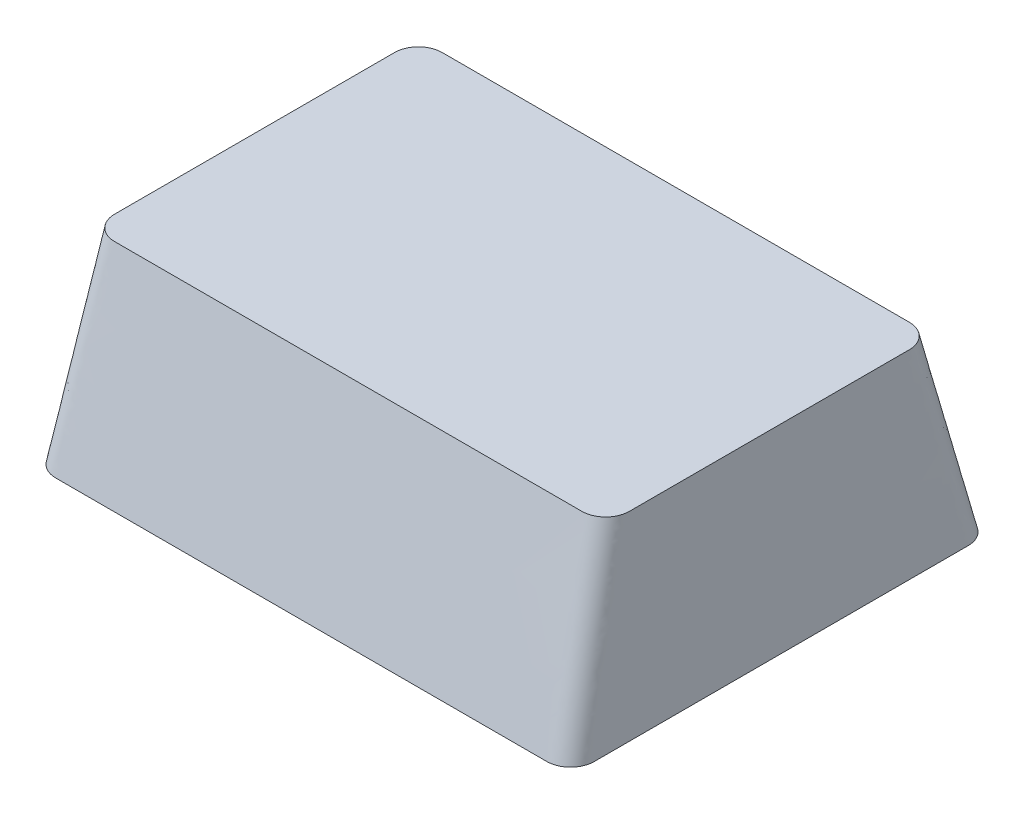
ISO-10303-21;
HEADER;
FILE_DESCRIPTION(('STEP AP214'),'2;1');
FILE_NAME('part.step','',(''),(''),'','','');
FILE_SCHEMA(('AUTOMOTIVE_DESIGN { 1 0 10303 214 1 1 1 1 }'));
ENDSEC;
DATA;
#1=APPLICATION_CONTEXT('core data for automotive mechanical design processes');
#2=APPLICATION_PROTOCOL_DEFINITION('international standard','automotive_design',2000,#1);
#3=PRODUCT_CONTEXT('',#1,'mechanical');
#4=PRODUCT('Part','Part','',(#3));
#5=PRODUCT_RELATED_PRODUCT_CATEGORY('part','',(#4));
#6=PRODUCT_DEFINITION_FORMATION('','',#4);
#7=PRODUCT_DEFINITION_CONTEXT('part definition',#1,'design');
#8=PRODUCT_DEFINITION('design','',#6,#7);
#9=PRODUCT_DEFINITION_SHAPE('','',#8);
#10=(LENGTH_UNIT() NAMED_UNIT(*) SI_UNIT(.MILLI.,.METRE.));
#11=(NAMED_UNIT(*) PLANE_ANGLE_UNIT() SI_UNIT($,.RADIAN.));
#12=(NAMED_UNIT(*) SI_UNIT($,.STERADIAN.) SOLID_ANGLE_UNIT());
#13=UNCERTAINTY_MEASURE_WITH_UNIT(LENGTH_MEASURE(1.E-05),#10,'distance_accuracy_value','');
#14=(GEOMETRIC_REPRESENTATION_CONTEXT(3) GLOBAL_UNCERTAINTY_ASSIGNED_CONTEXT((#13)) GLOBAL_UNIT_ASSIGNED_CONTEXT((#10,
#11,#12)) REPRESENTATION_CONTEXT('',''));
#15=CARTESIAN_POINT('',(0.,0.,0.));
#16=DIRECTION('',(0.,0.,1.));
#17=DIRECTION('',(1.,0.,0.));
#18=AXIS2_PLACEMENT_3D('',#15,#16,#17);
#19=CARTESIAN_POINT('',(-10.4902,0.,-7.9883));
#20=DIRECTION('',(0.,-1.,0.));
#21=DIRECTION('',(0.,0.,-1.));
#22=AXIS2_PLACEMENT_3D('',#19,#20,#21);
#23=PLANE('',#22);
#24=CARTESIAN_POINT('',(-10.4902,0.,-7.9883));
#25=DIRECTION('',(0.,1.,0.));
#26=DIRECTION('',(0.,0.,-1.));
#27=AXIS2_PLACEMENT_3D('',#24,#25,#26);
#28=CIRCLE('',#27,1.016);
#29=CARTESIAN_POINT('',(-10.4901999999162,0.,-9.0043));
#30=VERTEX_POINT('',#29);
#31=CARTESIAN_POINT('',(-11.5062,0.,-7.9883));
#32=VERTEX_POINT('',#31);
#33=EDGE_CURVE('E309',#30,#32,#28,.T.);
#34=ORIENTED_EDGE('',*,*,#33,.F.);
#35=DIRECTION('',(-1.,0.,0.));
#36=VECTOR('',#35,1.);
#37=CARTESIAN_POINT('',(-10.4902,0.,-9.0043));
#38=LINE('',#37,#36);
#39=CARTESIAN_POINT('',(10.4902,0.,-9.0043));
#40=VERTEX_POINT('',#39);
#41=EDGE_CURVE('E541',#40,#30,#38,.T.);
#42=ORIENTED_EDGE('',*,*,#41,.F.);
#43=CARTESIAN_POINT('',(10.4902,0.,-7.9883));
#44=DIRECTION('',(0.,1.,0.));
#45=DIRECTION('',(0.,0.,-1.));
#46=AXIS2_PLACEMENT_3D('',#43,#44,#45);
#47=CIRCLE('',#46,1.016);
#48=CARTESIAN_POINT('',(11.5062,0.,-7.98829999999678));
#49=VERTEX_POINT('',#48);
#50=EDGE_CURVE('E532',#49,#40,#47,.T.);
#51=ORIENTED_EDGE('',*,*,#50,.F.);
#52=DIRECTION('',(0.,0.,-1.));
#53=VECTOR('',#52,1.);
#54=CARTESIAN_POINT('',(11.5062,0.,7.9883));
#55=LINE('',#54,#53);
#56=CARTESIAN_POINT('',(11.5062,0.,7.98829999991866));
#57=VERTEX_POINT('',#56);
#58=EDGE_CURVE('E523',#57,#49,#55,.T.);
#59=ORIENTED_EDGE('',*,*,#58,.F.);
#60=CARTESIAN_POINT('',(10.4902,0.,7.9883));
#61=DIRECTION('',(0.,1.,0.));
#62=DIRECTION('',(0.,0.,1.));
#63=AXIS2_PLACEMENT_3D('',#60,#61,#62);
#64=CIRCLE('',#63,1.016);
#65=CARTESIAN_POINT('',(10.4901999999165,0.,9.0043));
#66=VERTEX_POINT('',#65);
#67=EDGE_CURVE('E514',#66,#57,#64,.T.);
#68=ORIENTED_EDGE('',*,*,#67,.F.);
#69=DIRECTION('',(1.,0.,0.));
#70=VECTOR('',#69,1.);
#71=CARTESIAN_POINT('',(-10.4902,0.,9.0043));
#72=LINE('',#71,#70);
#73=CARTESIAN_POINT('',(-10.4902,0.,9.0043));
#74=VERTEX_POINT('',#73);
#75=EDGE_CURVE('E508',#74,#66,#72,.T.);
#76=ORIENTED_EDGE('',*,*,#75,.F.);
#77=CARTESIAN_POINT('',(-10.4902,0.,7.9883));
#78=DIRECTION('',(0.,1.,0.));
#79=DIRECTION('',(0.,0.,-1.));
#80=AXIS2_PLACEMENT_3D('',#77,#78,#79);
#81=CIRCLE('',#80,1.016);
#82=CARTESIAN_POINT('',(-11.5062,0.,7.9883));
#83=VERTEX_POINT('',#82);
#84=EDGE_CURVE('E242',#83,#74,#81,.T.);
#85=ORIENTED_EDGE('',*,*,#84,.F.);
#86=DIRECTION('',(0.,0.,1.));
#87=VECTOR('',#86,1.);
#88=CARTESIAN_POINT('',(-11.5062,0.,7.9883));
#89=LINE('',#88,#87);
#90=EDGE_CURVE('E12',#32,#83,#89,.T.);
#91=ORIENTED_EDGE('',*,*,#90,.F.);
#92=EDGE_LOOP('',(#34,#42,#51,#59,#68,#76,#85,#91));
#93=FACE_BOUND('',#92,.T.);
#94=ADVANCED_FACE('F232',(#93),#23,.T.);
#95=CARTESIAN_POINT('',(9.9822,8.001,-5.9817));
#96=DIRECTION('',(0.,-1.,0.));
#97=DIRECTION('',(0.,0.,-1.));
#98=AXIS2_PLACEMENT_3D('',#95,#96,#97);
#99=PLANE('',#98);
#100=CARTESIAN_POINT('',(9.9822,8.001,-5.9817));
#101=DIRECTION('',(0.,1.,0.));
#102=DIRECTION('',(0.,0.,-1.));
#103=AXIS2_PLACEMENT_3D('',#100,#101,#102);
#104=CIRCLE('',#103,1.016);
#105=CARTESIAN_POINT('',(10.9982,8.001,-5.9817));
#106=VERTEX_POINT('',#105);
#107=CARTESIAN_POINT('',(9.9822,8.001,-6.9977));
#108=VERTEX_POINT('',#107);
#109=EDGE_CURVE('E305',#106,#108,#104,.T.);
#110=ORIENTED_EDGE('',*,*,#109,.T.);
#111=DIRECTION('',(-1.,0.,0.));
#112=VECTOR('',#111,1.);
#113=CARTESIAN_POINT('',(-9.9822,8.001,-6.9977));
#114=LINE('',#113,#112);
#115=CARTESIAN_POINT('',(-9.9822,8.001,-6.9977));
#116=VERTEX_POINT('',#115);
#117=EDGE_CURVE('E297',#108,#116,#114,.T.);
#118=ORIENTED_EDGE('',*,*,#117,.T.);
#119=CARTESIAN_POINT('',(-9.9822,8.001,-5.9817));
#120=DIRECTION('',(0.,1.,0.));
#121=DIRECTION('',(0.,0.,-1.));
#122=AXIS2_PLACEMENT_3D('',#119,#120,#121);
#123=CIRCLE('',#122,1.016);
#124=CARTESIAN_POINT('',(-10.9982,8.001,-5.9817));
#125=VERTEX_POINT('',#124);
#126=EDGE_CURVE('E301',#116,#125,#123,.T.);
#127=ORIENTED_EDGE('',*,*,#126,.T.);
#128=DIRECTION('',(0.,0.,1.));
#129=VECTOR('',#128,1.);
#130=CARTESIAN_POINT('',(-10.9982,8.001,5.9817));
#131=LINE('',#130,#129);
#132=CARTESIAN_POINT('',(-10.9982,8.001,5.9817));
#133=VERTEX_POINT('',#132);
#134=EDGE_CURVE('E316',#125,#133,#131,.T.);
#135=ORIENTED_EDGE('',*,*,#134,.T.);
#136=CARTESIAN_POINT('',(-9.9822,8.001,5.9817));
#137=DIRECTION('',(0.,1.,0.));
#138=DIRECTION('',(0.,0.,-1.));
#139=AXIS2_PLACEMENT_3D('',#136,#137,#138);
#140=CIRCLE('',#139,1.016);
#141=CARTESIAN_POINT('',(-9.9822,8.001,6.9977));
#142=VERTEX_POINT('',#141);
#143=EDGE_CURVE('E440',#133,#142,#140,.T.);
#144=ORIENTED_EDGE('',*,*,#143,.T.);
#145=DIRECTION('',(1.,0.,0.));
#146=VECTOR('',#145,1.);
#147=CARTESIAN_POINT('',(-9.9822,8.001,6.9977));
#148=LINE('',#147,#146);
#149=CARTESIAN_POINT('',(9.9822,8.001,6.9977));
#150=VERTEX_POINT('',#149);
#151=EDGE_CURVE('E457',#142,#150,#148,.T.);
#152=ORIENTED_EDGE('',*,*,#151,.T.);
#153=CARTESIAN_POINT('',(9.9822,8.001,5.9817));
#154=DIRECTION('',(0.,1.,0.));
#155=DIRECTION('',(0.,0.,1.));
#156=AXIS2_PLACEMENT_3D('',#153,#154,#155);
#157=CIRCLE('',#156,1.016);
#158=CARTESIAN_POINT('',(10.9982,8.001,5.9817));
#159=VERTEX_POINT('',#158);
#160=EDGE_CURVE('E460',#150,#159,#157,.T.);
#161=ORIENTED_EDGE('',*,*,#160,.T.);
#162=DIRECTION('',(0.,0.,-1.));
#163=VECTOR('',#162,1.);
#164=CARTESIAN_POINT('',(10.9982,8.001,5.9817));
#165=LINE('',#164,#163);
#166=EDGE_CURVE('E478',#159,#106,#165,.T.);
#167=ORIENTED_EDGE('',*,*,#166,.T.);
#168=EDGE_LOOP('',(#110,#118,#127,#135,#144,#152,#161,#167));
#169=FACE_BOUND('',#168,.T.);
#170=ADVANCED_FACE('F300',(#169),#99,.F.);
#171=CARTESIAN_POINT('',(-9.9821999992146,8.001,-6.9977));
#172=CARTESIAN_POINT('',(-10.4901999991776,0.,-9.0043));
#173=CARTESIAN_POINT('',(-8.3156387090877,8.001,-6.9977));
#174=CARTESIAN_POINT('',(-8.74510436639633,0.,-9.0043));
#175=CARTESIAN_POINT('',(-4.9868189676382,8.001,-6.99769999999999));
#176=CARTESIAN_POINT('',(-5.25002016085883,0.,-9.00430000000001));
#177=CARTESIAN_POINT('',(0.,8.001,-6.99770000000001));
#178=CARTESIAN_POINT('',(0.,0.,-9.0043));
#179=CARTESIAN_POINT('',(4.9868189676382,8.00099999999999,-6.99769999999999));
#180=CARTESIAN_POINT('',(5.25002016085883,0.,-9.0043));
#181=CARTESIAN_POINT('',(8.31563870908769,8.001,-6.9977));
#182=CARTESIAN_POINT('',(8.74510436639632,0.,-9.0043));
#183=CARTESIAN_POINT('',(10.1123327972429,8.001,-6.9977));
#184=CARTESIAN_POINT('',(10.6264651211783,0.,-9.0043));
#185=CARTESIAN_POINT('',(10.3850781656718,8.001,-6.94637622935646));
#186=CARTESIAN_POINT('',(10.8866226484583,0.,-8.9500537005938));
#187=CARTESIAN_POINT('',(10.7407733927544,8.001,-6.70112265072094));
#188=CARTESIAN_POINT('',(11.211070009126,0.,-8.73824626538668));
#189=CARTESIAN_POINT('',(10.9574755196119,8.001,-6.34672996806996));
#190=CARTESIAN_POINT('',(11.4403443291089,0.,-8.41639388634618));
#191=CARTESIAN_POINT('',(10.9982,8.001,-6.0985563767538));
#192=CARTESIAN_POINT('',(11.5062,0.,-8.13974274963668));
#193=CARTESIAN_POINT('',(10.9982,8.001,-4.96861228851217));
#194=CARTESIAN_POINT('',(11.5062,0.,-6.67536532828676));
#195=CARTESIAN_POINT('',(10.9982,8.001,-2.96721368440715));
#196=CARTESIAN_POINT('',(11.5062,0.,-4.0223987692796));
#197=CARTESIAN_POINT('',(10.9982,8.001,0.));
#198=CARTESIAN_POINT('',(11.5062,0.,0.));
#199=CARTESIAN_POINT('',(10.9982,8.001,2.96721368440716));
#200=CARTESIAN_POINT('',(11.5062,0.,4.0223987692796));
#201=CARTESIAN_POINT('',(10.9982,8.001,4.96861228851217));
#202=CARTESIAN_POINT('',(11.5062,0.,6.67536532828676));
#203=CARTESIAN_POINT('',(10.9982,8.001,6.0985563767538));
#204=CARTESIAN_POINT('',(11.5062,0.,8.13974274963668));
#205=CARTESIAN_POINT('',(10.9574755196119,8.00099999999999,6.34672996806995));
#206=CARTESIAN_POINT('',(11.4403443291089,0.,8.41639388634617));
#207=CARTESIAN_POINT('',(10.7407733927544,8.00100000000001,6.70112265072096));
#208=CARTESIAN_POINT('',(11.211070009126,0.,8.73824626538669));
#209=CARTESIAN_POINT('',(10.3850781656718,8.00099999999999,6.94637622935646));
#210=CARTESIAN_POINT('',(10.8866226484583,0.,8.9500537005938));
#211=CARTESIAN_POINT('',(10.1123327972429,8.001,6.9977));
#212=CARTESIAN_POINT('',(10.6264651211783,0.,9.0043));
#213=CARTESIAN_POINT('',(8.31563870908769,8.001,6.9977));
#214=CARTESIAN_POINT('',(8.74510436639633,0.,9.0043));
#215=CARTESIAN_POINT('',(4.9868189676382,8.001,6.9977));
#216=CARTESIAN_POINT('',(5.25002016085883,0.,9.00430000000001));
#217=CARTESIAN_POINT('',(0.,8.00099999999999,6.99770000000001));
#218=CARTESIAN_POINT('',(0.,0.,9.0043));
#219=CARTESIAN_POINT('',(-4.9868189676382,8.001,6.99769999999999));
#220=CARTESIAN_POINT('',(-5.25002016085881,0.,9.0043));
#221=CARTESIAN_POINT('',(-8.3156387090877,8.001,6.9977));
#222=CARTESIAN_POINT('',(-8.74510436639633,0.,9.0043));
#223=CARTESIAN_POINT('',(-10.1123327972429,8.001,6.9977));
#224=CARTESIAN_POINT('',(-10.6264651211783,0.,9.0043));
#225=CARTESIAN_POINT('',(-10.3850781656718,8.001,6.94637622935647));
#226=CARTESIAN_POINT('',(-10.8866226484583,0.,8.9500537005938));
#227=CARTESIAN_POINT('',(-10.7407733927544,8.00099999999999,6.70112265072094));
#228=CARTESIAN_POINT('',(-11.211070009126,0.,8.73824626538668));
#229=CARTESIAN_POINT('',(-10.9574755196119,8.001,6.34672996806996));
#230=CARTESIAN_POINT('',(-11.4403443291089,0.,8.41639388634619));
#231=CARTESIAN_POINT('',(-10.9982,8.001,6.0985563767538));
#232=CARTESIAN_POINT('',(-11.5062,0.,8.13974274963668));
#233=CARTESIAN_POINT('',(-10.9982,8.001,4.96861228851217));
#234=CARTESIAN_POINT('',(-11.5062,0.,6.67536532828676));
#235=CARTESIAN_POINT('',(-10.9982,8.001,2.96721368440716));
#236=CARTESIAN_POINT('',(-11.5062,0.,4.0223987692796));
#237=CARTESIAN_POINT('',(-10.9982,8.00099999999999,0.));
#238=CARTESIAN_POINT('',(-11.5062,0.,0.));
#239=CARTESIAN_POINT('',(-10.9982,8.001,-2.96721368440715));
#240=CARTESIAN_POINT('',(-11.5062,0.,-4.0223987692796));
#241=CARTESIAN_POINT('',(-10.9982,8.001,-4.96861228851217));
#242=CARTESIAN_POINT('',(-11.5062,0.,-6.67536532828676));
#243=CARTESIAN_POINT('',(-10.9982,8.001,-6.0985563767538));
#244=CARTESIAN_POINT('',(-11.5062,0.,-8.13974274963668));
#245=CARTESIAN_POINT('',(-10.9574755196119,8.00100000000001,-6.34672996806996));
#246=CARTESIAN_POINT('',(-11.4403443291089,0.,-8.41639388634617));
#247=CARTESIAN_POINT('',(-10.7407733927544,8.00099999999999,-6.70112265072095));
#248=CARTESIAN_POINT('',(-11.211070009126,0.,-8.73824626538669));
#249=CARTESIAN_POINT('',(-10.3850781656718,8.001,-6.94637622935646));
#250=CARTESIAN_POINT('',(-10.8866226484583,0.,-8.9500537005938));
#251=CARTESIAN_POINT('',(-10.1123327972429,8.001,-6.9977));
#252=CARTESIAN_POINT('',(-10.6264651211783,0.,-9.0043));
#253=CARTESIAN_POINT('',(-9.9821999992146,8.001,-6.9977));
#254=CARTESIAN_POINT('',(-10.4901999991776,0.,-9.0043));
#255=B_SPLINE_SURFACE_WITH_KNOTS('',3,1,((#171,#172),(#173,#174),(#175,#176),(#177,#178),(#179,
#180),(#181,#182),(#183,#184),(#185,#186),(#187,#188),(#189,#190),(#191,#192),(#193,#194),(#195,
#196),(#197,#198),(#199,#200),(#201,#202),(#203,#204),(#205,#206),(#207,#208),(#209,#210),(#211,
#212),(#213,#214),(#215,#216),(#217,#218),(#219,#220),(#221,#222),(#223,#224),(#225,#226),(#227,
#228),(#229,#230),(#231,#232),(#233,#234),(#235,#236),(#237,#238),(#239,#240),(#241,#242),(#243,
#244),(#245,#246),(#247,#248),(#249,#250),(#251,#252),(#253,#254)),.UNSPECIFIED.,.T.,.F.,.F.,(4,
1,1,1,2,1,1,1,2,1,1,1,2,1,1,1,2,1,1,1,2,1,1,1,2,1,1,1,2,1,1,1,4),(2,2),(0.,0.068189577858536,
0.136379155717072,0.204568733575608,0.272758311434144,0.27808286842204,0.283407425409937,
0.288731982397833,0.294056539385729,0.3402178475514,0.386379155717072,0.432540463882744,
0.478701772048415,0.484026329036311,0.489350886024208,0.494675443012104,0.5,0.568189577858536,
0.636379155717072,0.704568733575608,0.772758311434144,0.77808286842204,0.783407425409936,
0.788731982397833,0.794056539385729,0.8402178475514,0.886379155717072,0.932540463882744,
0.978701772048415,0.984026329036312,0.989350886024208,0.994675443012104,1.),(0.,1.),.UNSPECIFIED.);
#256=ORIENTED_EDGE('',*,*,#109,.F.);
#257=ORIENTED_EDGE('',*,*,#166,.F.);
#258=ORIENTED_EDGE('',*,*,#160,.F.);
#259=ORIENTED_EDGE('',*,*,#151,.F.);
#260=ORIENTED_EDGE('',*,*,#143,.F.);
#261=ORIENTED_EDGE('',*,*,#134,.F.);
#262=ORIENTED_EDGE('',*,*,#126,.F.);
#263=ORIENTED_EDGE('',*,*,#117,.F.);
#264=EDGE_LOOP('',(#256,#257,#258,#259,#260,#261,#262,#263));
#265=FACE_BOUND('',#264,.T.);
#266=ORIENTED_EDGE('',*,*,#90,.T.);
#267=ORIENTED_EDGE('',*,*,#84,.T.);
#268=ORIENTED_EDGE('',*,*,#75,.T.);
#269=ORIENTED_EDGE('',*,*,#67,.T.);
#270=ORIENTED_EDGE('',*,*,#58,.T.);
#271=ORIENTED_EDGE('',*,*,#50,.T.);
#272=ORIENTED_EDGE('',*,*,#41,.T.);
#273=ORIENTED_EDGE('',*,*,#33,.T.);
#274=EDGE_LOOP('',(#266,#267,#268,#269,#270,#271,#272,#273));
#275=FACE_BOUND('',#274,.T.);
#276=ADVANCED_FACE('F314',(#265,#275),#255,.T.);
#277=CLOSED_SHELL('',(#94,#170,#276));
#278=MANIFOLD_SOLID_BREP('B2',#277);
#279=ADVANCED_BREP_SHAPE_REPRESENTATION('',(#18,#278),#14);
#280=SHAPE_DEFINITION_REPRESENTATION(#9,#279);
ENDSEC;
END-ISO-10303-21;
